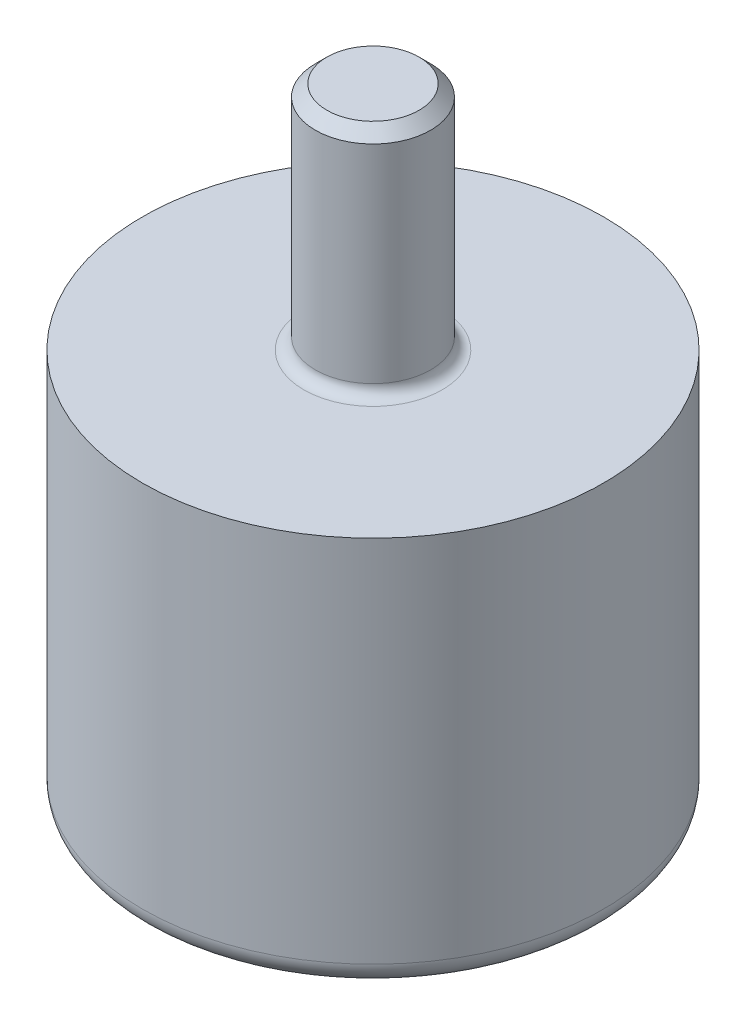
ISO-10303-21;
HEADER;
FILE_DESCRIPTION(('STEP AP214'),'2;1');
FILE_NAME('part.step','',(''),(''),'','','');
FILE_SCHEMA(('AUTOMOTIVE_DESIGN { 1 0 10303 214 1 1 1 1 }'));
ENDSEC;
DATA;
#1=APPLICATION_CONTEXT('core data for automotive mechanical design processes');
#2=APPLICATION_PROTOCOL_DEFINITION('international standard','automotive_design',2000,#1);
#3=PRODUCT_CONTEXT('',#1,'mechanical');
#4=PRODUCT('Part','Part','',(#3));
#5=PRODUCT_RELATED_PRODUCT_CATEGORY('part','',(#4));
#6=PRODUCT_DEFINITION_FORMATION('','',#4);
#7=PRODUCT_DEFINITION_CONTEXT('part definition',#1,'design');
#8=PRODUCT_DEFINITION('design','',#6,#7);
#9=PRODUCT_DEFINITION_SHAPE('','',#8);
#10=(LENGTH_UNIT() NAMED_UNIT(*) SI_UNIT(.MILLI.,.METRE.));
#11=(NAMED_UNIT(*) PLANE_ANGLE_UNIT() SI_UNIT($,.RADIAN.));
#12=(NAMED_UNIT(*) SI_UNIT($,.STERADIAN.) SOLID_ANGLE_UNIT());
#13=UNCERTAINTY_MEASURE_WITH_UNIT(LENGTH_MEASURE(1.E-05),#10,'distance_accuracy_value','');
#14=(GEOMETRIC_REPRESENTATION_CONTEXT(3) GLOBAL_UNCERTAINTY_ASSIGNED_CONTEXT((#13)) GLOBAL_UNIT_ASSIGNED_CONTEXT((#10,
#11,#12)) REPRESENTATION_CONTEXT('',''));
#15=CARTESIAN_POINT('',(0.,0.,0.));
#16=DIRECTION('',(0.,0.,1.));
#17=DIRECTION('',(1.,0.,0.));
#18=AXIS2_PLACEMENT_3D('',#15,#16,#17);
#19=CARTESIAN_POINT('',(0.,17.,0.));
#20=DIRECTION('',(0.,1.,0.));
#21=DIRECTION('',(0.,0.,1.));
#22=AXIS2_PLACEMENT_3D('',#19,#20,#21);
#23=PLANE('',#22);
#24=CARTESIAN_POINT('',(0.,17.,0.));
#25=DIRECTION('',(0.,1.,0.));
#26=DIRECTION('',(0.,0.,1.));
#27=AXIS2_PLACEMENT_3D('',#24,#25,#26);
#28=CIRCLE('',#27,3.);
#29=CARTESIAN_POINT('',(0.,17.,3.));
#30=VERTEX_POINT('',#29);
#31=EDGE_CURVE('E10',#30,#30,#28,.F.);
#32=ORIENTED_EDGE('',*,*,#31,.T.);
#33=EDGE_LOOP('',(#32));
#34=FACE_BOUND('',#33,.T.);
#35=CARTESIAN_POINT('',(0.,17.,0.));
#36=DIRECTION('',(0.,-1.,0.));
#37=DIRECTION('',(0.,0.,-1.));
#38=AXIS2_PLACEMENT_3D('',#35,#36,#37);
#39=CIRCLE('',#38,10.);
#40=CARTESIAN_POINT('',(0.,17.,-10.));
#41=VERTEX_POINT('',#40);
#42=EDGE_CURVE('E57',#41,#41,#39,.T.);
#43=ORIENTED_EDGE('',*,*,#42,.F.);
#44=EDGE_LOOP('',(#43));
#45=FACE_BOUND('',#44,.T.);
#46=ADVANCED_FACE('F28',(#34,#45),#23,.T.);
#47=CARTESIAN_POINT('',(0.,3.25,0.));
#48=DIRECTION('',(0.,-1.,0.));
#49=DIRECTION('',(1.,0.,0.));
#50=AXIS2_PLACEMENT_3D('',#47,#48,#49);
#51=SPHERICAL_SURFACE('',#50,6.25);
#52=CARTESIAN_POINT('',(0.,0.,0.));
#53=DIRECTION('',(0.,-1.,0.));
#54=DIRECTION('',(0.,0.,-1.));
#55=AXIS2_PLACEMENT_3D('',#52,#53,#54);
#56=CIRCLE('',#55,5.33853912601565);
#57=CARTESIAN_POINT('',(0.,0.,-5.33853912601565));
#58=VERTEX_POINT('',#57);
#59=EDGE_CURVE('E54',#58,#58,#56,.T.);
#60=ORIENTED_EDGE('',*,*,#59,.T.);
#61=EDGE_LOOP('',(#60));
#62=FACE_BOUND('',#61,.T.);
#63=ADVANCED_FACE('F64',(#62),#51,.F.);
#64=CARTESIAN_POINT('',(10.,0.,0.));
#65=DIRECTION('',(0.,-1.,0.));
#66=DIRECTION('',(0.,0.,-1.));
#67=AXIS2_PLACEMENT_3D('',#64,#65,#66);
#68=PLANE('',#67);
#69=CARTESIAN_POINT('',(0.,0.,0.));
#70=DIRECTION('',(0.,-1.,0.));
#71=DIRECTION('',(0.,0.,-1.));
#72=AXIS2_PLACEMENT_3D('',#69,#70,#71);
#73=CIRCLE('',#72,9.);
#74=CARTESIAN_POINT('',(0.,0.,-9.));
#75=VERTEX_POINT('',#74);
#76=EDGE_CURVE('E51',#75,#75,#73,.T.);
#77=ORIENTED_EDGE('',*,*,#76,.T.);
#78=EDGE_LOOP('',(#77));
#79=FACE_BOUND('',#78,.T.);
#80=ORIENTED_EDGE('',*,*,#59,.F.);
#81=EDGE_LOOP('',(#80));
#82=FACE_BOUND('',#81,.T.);
#83=ADVANCED_FACE('F69',(#79,#82),#68,.T.);
#84=CARTESIAN_POINT('',(0.,0.,0.));
#85=DIRECTION('',(0.,-1.,0.));
#86=DIRECTION('',(0.,0.,-1.));
#87=AXIS2_PLACEMENT_3D('',#84,#85,#86);
#88=CYLINDRICAL_SURFACE('',#87,10.);
#89=CARTESIAN_POINT('',(0.,1.,0.));
#90=DIRECTION('',(0.,-1.,0.));
#91=DIRECTION('',(0.,0.,-1.));
#92=AXIS2_PLACEMENT_3D('',#89,#90,#91);
#93=CIRCLE('',#92,10.);
#94=CARTESIAN_POINT('',(0.,1.,-10.));
#95=VERTEX_POINT('',#94);
#96=EDGE_CURVE('E48',#95,#95,#93,.F.);
#97=ORIENTED_EDGE('',*,*,#96,.T.);
#98=EDGE_LOOP('',(#97));
#99=FACE_BOUND('',#98,.T.);
#100=ORIENTED_EDGE('',*,*,#42,.T.);
#101=EDGE_LOOP('',(#100));
#102=FACE_BOUND('',#101,.T.);
#103=ADVANCED_FACE('F61',(#99,#102),#88,.T.);
#104=CARTESIAN_POINT('',(0.,27.,0.));
#105=DIRECTION('',(0.,-1.,0.));
#106=DIRECTION('',(0.,0.,-1.));
#107=AXIS2_PLACEMENT_3D('',#104,#105,#106);
#108=CYLINDRICAL_SURFACE('',#107,2.5);
#109=CARTESIAN_POINT('',(0.,17.5,0.));
#110=DIRECTION('',(0.,1.,0.));
#111=DIRECTION('',(0.,0.,1.));
#112=AXIS2_PLACEMENT_3D('',#109,#110,#111);
#113=CIRCLE('',#112,2.5);
#114=CARTESIAN_POINT('',(0.,17.5,2.5));
#115=VERTEX_POINT('',#114);
#116=EDGE_CURVE('E35',#115,#115,#113,.T.);
#117=ORIENTED_EDGE('',*,*,#116,.T.);
#118=EDGE_LOOP('',(#117));
#119=FACE_BOUND('',#118,.T.);
#120=CARTESIAN_POINT('',(0.,26.5,0.));
#121=DIRECTION('',(0.,1.,0.));
#122=DIRECTION('',(0.,0.,1.));
#123=AXIS2_PLACEMENT_3D('',#120,#121,#122);
#124=CIRCLE('',#123,2.5);
#125=CARTESIAN_POINT('',(0.,26.5,2.5));
#126=VERTEX_POINT('',#125);
#127=EDGE_CURVE('E39',#126,#126,#124,.F.);
#128=ORIENTED_EDGE('',*,*,#127,.T.);
#129=EDGE_LOOP('',(#128));
#130=FACE_BOUND('',#129,.T.);
#131=ADVANCED_FACE('F74',(#119,#130),#108,.T.);
#132=CARTESIAN_POINT('',(0.,27.,0.));
#133=DIRECTION('',(0.,1.,0.));
#134=DIRECTION('',(0.,0.,1.));
#135=AXIS2_PLACEMENT_3D('',#132,#133,#134);
#136=PLANE('',#135);
#137=CARTESIAN_POINT('',(0.,27.,0.));
#138=DIRECTION('',(0.,1.,0.));
#139=DIRECTION('',(0.,0.,1.));
#140=AXIS2_PLACEMENT_3D('',#137,#138,#139);
#141=CIRCLE('',#140,1.99999999999999);
#142=CARTESIAN_POINT('',(0.,27.,1.99999999999999));
#143=VERTEX_POINT('',#142);
#144=EDGE_CURVE('E43',#143,#143,#141,.T.);
#145=ORIENTED_EDGE('',*,*,#144,.T.);
#146=EDGE_LOOP('',(#145));
#147=FACE_BOUND('',#146,.T.);
#148=ADVANCED_FACE('F85',(#147),#136,.T.);
#149=CARTESIAN_POINT('',(0.,1.,0.));
#150=DIRECTION('',(0.,-1.,0.));
#151=DIRECTION('',(0.,0.,-1.));
#152=AXIS2_PLACEMENT_3D('',#149,#150,#151);
#153=TOROIDAL_SURFACE('',#152,9.,1.);
#154=ORIENTED_EDGE('',*,*,#96,.F.);
#155=EDGE_LOOP('',(#154));
#156=FACE_BOUND('',#155,.T.);
#157=ORIENTED_EDGE('',*,*,#76,.F.);
#158=EDGE_LOOP('',(#157));
#159=FACE_BOUND('',#158,.T.);
#160=ADVANCED_FACE('F82',(#156,#159),#153,.T.);
#161=CARTESIAN_POINT('',(0.,27.,0.));
#162=DIRECTION('',(0.,-1.,0.));
#163=DIRECTION('',(0.,0.,-1.));
#164=AXIS2_PLACEMENT_3D('',#161,#162,#163);
#165=CONICAL_SURFACE('',#164,1.99999999999999,0.785398163397446);
#166=ORIENTED_EDGE('',*,*,#127,.F.);
#167=EDGE_LOOP('',(#166));
#168=FACE_BOUND('',#167,.T.);
#169=ORIENTED_EDGE('',*,*,#144,.F.);
#170=EDGE_LOOP('',(#169));
#171=FACE_BOUND('',#170,.T.);
#172=ADVANCED_FACE('F84',(#168,#171),#165,.T.);
#173=CARTESIAN_POINT('',(0.,17.5,0.));
#174=DIRECTION('',(0.,1.,0.));
#175=DIRECTION('',(0.,0.,1.));
#176=AXIS2_PLACEMENT_3D('',#173,#174,#175);
#177=TOROIDAL_SURFACE('',#176,3.,0.5);
#178=ORIENTED_EDGE('',*,*,#31,.F.);
#179=EDGE_LOOP('',(#178));
#180=FACE_BOUND('',#179,.T.);
#181=ORIENTED_EDGE('',*,*,#116,.F.);
#182=EDGE_LOOP('',(#181));
#183=FACE_BOUND('',#182,.T.);
#184=ADVANCED_FACE('F30',(#180,#183),#177,.F.);
#185=CLOSED_SHELL('',(#46,#63,#83,#103,#131,#148,#160,#172,#184));
#186=MANIFOLD_SOLID_BREP('B2',#185);
#187=ADVANCED_BREP_SHAPE_REPRESENTATION('',(#18,#186),#14);
#188=SHAPE_DEFINITION_REPRESENTATION(#9,#187);
ENDSEC;
END-ISO-10303-21;
